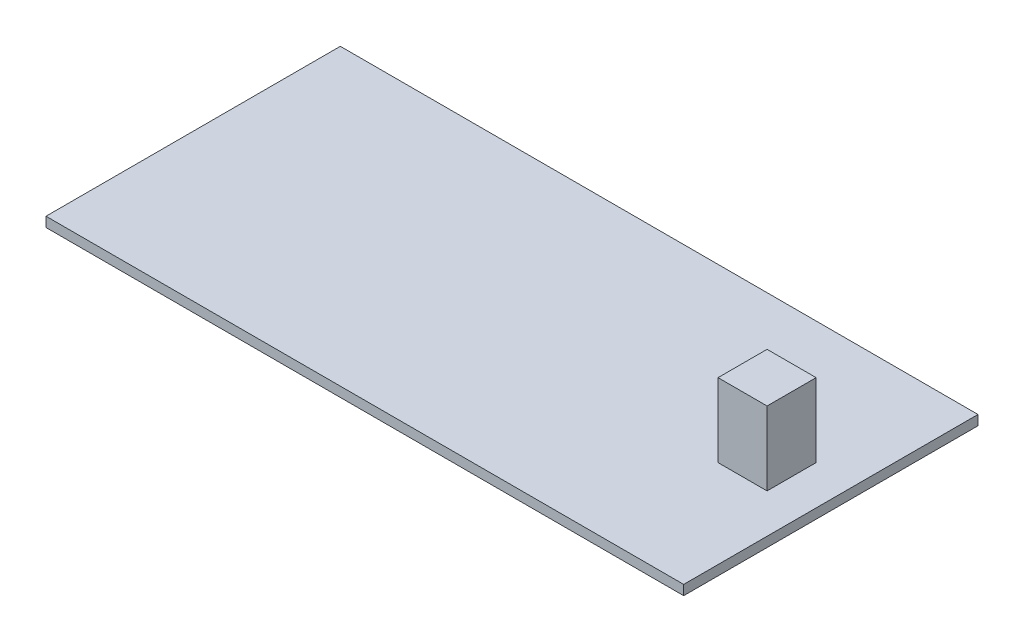
ISO-10303-21;
HEADER;
FILE_DESCRIPTION(('STEP AP214'),'2;1');
FILE_NAME('part.step','',(''),(''),'','','');
FILE_SCHEMA(('AUTOMOTIVE_DESIGN { 1 0 10303 214 1 1 1 1 }'));
ENDSEC;
DATA;
#1=APPLICATION_CONTEXT('core data for automotive mechanical design processes');
#2=APPLICATION_PROTOCOL_DEFINITION('international standard','automotive_design',2000,#1);
#3=PRODUCT_CONTEXT('',#1,'mechanical');
#4=PRODUCT('Part','Part','',(#3));
#5=PRODUCT_RELATED_PRODUCT_CATEGORY('part','',(#4));
#6=PRODUCT_DEFINITION_FORMATION('','',#4);
#7=PRODUCT_DEFINITION_CONTEXT('part definition',#1,'design');
#8=PRODUCT_DEFINITION('design','',#6,#7);
#9=PRODUCT_DEFINITION_SHAPE('','',#8);
#10=(LENGTH_UNIT() NAMED_UNIT(*) SI_UNIT(.MILLI.,.METRE.));
#11=(NAMED_UNIT(*) PLANE_ANGLE_UNIT() SI_UNIT($,.RADIAN.));
#12=(NAMED_UNIT(*) SI_UNIT($,.STERADIAN.) SOLID_ANGLE_UNIT());
#13=UNCERTAINTY_MEASURE_WITH_UNIT(LENGTH_MEASURE(1.E-05),#10,'distance_accuracy_value','');
#14=(GEOMETRIC_REPRESENTATION_CONTEXT(3) GLOBAL_UNCERTAINTY_ASSIGNED_CONTEXT((#13)) GLOBAL_UNIT_ASSIGNED_CONTEXT((#10,
#11,#12)) REPRESENTATION_CONTEXT('',''));
#15=CARTESIAN_POINT('',(0.,0.,0.));
#16=DIRECTION('',(0.,0.,1.));
#17=DIRECTION('',(1.,0.,0.));
#18=AXIS2_PLACEMENT_3D('',#15,#16,#17);
#19=CARTESIAN_POINT('',(0.,5.,0.));
#20=DIRECTION('',(0.,1.,0.));
#21=DIRECTION('',(0.,0.,1.));
#22=AXIS2_PLACEMENT_3D('',#19,#20,#21);
#23=PLANE('',#22);
#24=DIRECTION('',(1.,0.,0.));
#25=VECTOR('',#24,1.);
#26=CARTESIAN_POINT('',(0.,5.,150.));
#27=LINE('',#26,#25);
#28=CARTESIAN_POINT('',(-150.,5.,150.));
#29=VERTEX_POINT('',#28);
#30=CARTESIAN_POINT('',(500.,5.,150.));
#31=VERTEX_POINT('',#30);
#32=EDGE_CURVE('E145',#29,#31,#27,.T.);
#33=ORIENTED_EDGE('',*,*,#32,.T.);
#34=DIRECTION('',(0.,0.,1.));
#35=VECTOR('',#34,1.);
#36=CARTESIAN_POINT('',(500.,5.,0.));
#37=LINE('',#36,#35);
#38=CARTESIAN_POINT('',(500.,5.,-150.));
#39=VERTEX_POINT('',#38);
#40=EDGE_CURVE('E150',#39,#31,#37,.T.);
#41=ORIENTED_EDGE('',*,*,#40,.F.);
#42=DIRECTION('',(1.,0.,0.));
#43=VECTOR('',#42,1.);
#44=CARTESIAN_POINT('',(0.,5.,-150.));
#45=LINE('',#44,#43);
#46=CARTESIAN_POINT('',(-150.,5.,-150.));
#47=VERTEX_POINT('',#46);
#48=EDGE_CURVE('E170',#47,#39,#45,.T.);
#49=ORIENTED_EDGE('',*,*,#48,.F.);
#50=DIRECTION('',(0.,0.,1.));
#51=VECTOR('',#50,1.);
#52=CARTESIAN_POINT('',(-150.,5.,0.));
#53=LINE('',#52,#51);
#54=EDGE_CURVE('E158',#47,#29,#53,.T.);
#55=ORIENTED_EDGE('',*,*,#54,.T.);
#56=EDGE_LOOP('',(#33,#41,#49,#55));
#57=FACE_BOUND('',#56,.T.);
#58=DIRECTION('',(-1.,0.,0.));
#59=VECTOR('',#58,1.);
#60=CARTESIAN_POINT('',(410.,5.,-25.));
#61=LINE('',#60,#59);
#62=CARTESIAN_POINT('',(460.,5.,-25.));
#63=VERTEX_POINT('',#62);
#64=CARTESIAN_POINT('',(410.,5.,-25.));
#65=VERTEX_POINT('',#64);
#66=EDGE_CURVE('E293',#63,#65,#61,.T.);
#67=ORIENTED_EDGE('',*,*,#66,.F.);
#68=DIRECTION('',(0.,0.,-1.));
#69=VECTOR('',#68,1.);
#70=CARTESIAN_POINT('',(460.,5.,25.));
#71=LINE('',#70,#69);
#72=CARTESIAN_POINT('',(460.,5.,25.));
#73=VERTEX_POINT('',#72);
#74=EDGE_CURVE('E142',#73,#63,#71,.T.);
#75=ORIENTED_EDGE('',*,*,#74,.F.);
#76=DIRECTION('',(1.,0.,0.));
#77=VECTOR('',#76,1.);
#78=CARTESIAN_POINT('',(410.,5.,25.));
#79=LINE('',#78,#77);
#80=CARTESIAN_POINT('',(410.,5.,25.));
#81=VERTEX_POINT('',#80);
#82=EDGE_CURVE('E138',#81,#73,#79,.T.);
#83=ORIENTED_EDGE('',*,*,#82,.F.);
#84=DIRECTION('',(0.,0.,1.));
#85=VECTOR('',#84,1.);
#86=CARTESIAN_POINT('',(410.,5.,25.));
#87=LINE('',#86,#85);
#88=EDGE_CURVE('E289',#65,#81,#87,.T.);
#89=ORIENTED_EDGE('',*,*,#88,.F.);
#90=EDGE_LOOP('',(#67,#75,#83,#89));
#91=FACE_BOUND('',#90,.T.);
#92=ADVANCED_FACE('F43',(#57,#91),#23,.T.);
#93=CARTESIAN_POINT('',(0.,-5.,150.));
#94=DIRECTION('',(0.,0.,1.));
#95=DIRECTION('',(1.,0.,0.));
#96=AXIS2_PLACEMENT_3D('',#93,#94,#95);
#97=PLANE('',#96);
#98=ORIENTED_EDGE('',*,*,#32,.F.);
#99=DIRECTION('',(0.,1.,0.));
#100=VECTOR('',#99,1.);
#101=CARTESIAN_POINT('',(-150.,-5.,150.));
#102=LINE('',#101,#100);
#103=CARTESIAN_POINT('',(-150.,-5.,150.));
#104=VERTEX_POINT('',#103);
#105=EDGE_CURVE('E11',#104,#29,#102,.T.);
#106=ORIENTED_EDGE('',*,*,#105,.F.);
#107=DIRECTION('',(1.,0.,0.));
#108=VECTOR('',#107,1.);
#109=CARTESIAN_POINT('',(0.,-5.,150.));
#110=LINE('',#109,#108);
#111=CARTESIAN_POINT('',(500.,-5.,150.));
#112=VERTEX_POINT('',#111);
#113=EDGE_CURVE('E155',#104,#112,#110,.T.);
#114=ORIENTED_EDGE('',*,*,#113,.T.);
#115=DIRECTION('',(0.,1.,0.));
#116=VECTOR('',#115,1.);
#117=CARTESIAN_POINT('',(500.,-5.,150.));
#118=LINE('',#117,#116);
#119=EDGE_CURVE('E47',#112,#31,#118,.T.);
#120=ORIENTED_EDGE('',*,*,#119,.T.);
#121=EDGE_LOOP('',(#98,#106,#114,#120));
#122=FACE_BOUND('',#121,.T.);
#123=ADVANCED_FACE('F45',(#122),#97,.T.);
#124=CARTESIAN_POINT('',(-150.,-5.,0.));
#125=DIRECTION('',(-1.,0.,0.));
#126=DIRECTION('',(0.,0.,1.));
#127=AXIS2_PLACEMENT_3D('',#124,#125,#126);
#128=PLANE('',#127);
#129=ORIENTED_EDGE('',*,*,#54,.F.);
#130=DIRECTION('',(0.,1.,0.));
#131=VECTOR('',#130,1.);
#132=CARTESIAN_POINT('',(-150.,-5.,-150.));
#133=LINE('',#132,#131);
#134=CARTESIAN_POINT('',(-150.,-5.,-150.));
#135=VERTEX_POINT('',#134);
#136=EDGE_CURVE('E53',#135,#47,#133,.T.);
#137=ORIENTED_EDGE('',*,*,#136,.F.);
#138=DIRECTION('',(0.,0.,1.));
#139=VECTOR('',#138,1.);
#140=CARTESIAN_POINT('',(-150.,-5.,0.));
#141=LINE('',#140,#139);
#142=EDGE_CURVE('E164',#135,#104,#141,.T.);
#143=ORIENTED_EDGE('',*,*,#142,.T.);
#144=ORIENTED_EDGE('',*,*,#105,.T.);
#145=EDGE_LOOP('',(#129,#137,#143,#144));
#146=FACE_BOUND('',#145,.T.);
#147=ADVANCED_FACE('F188',(#146),#128,.T.);
#148=CARTESIAN_POINT('',(0.,-5.,-150.));
#149=DIRECTION('',(0.,0.,1.));
#150=DIRECTION('',(1.,0.,0.));
#151=AXIS2_PLACEMENT_3D('',#148,#149,#150);
#152=PLANE('',#151);
#153=ORIENTED_EDGE('',*,*,#48,.T.);
#154=DIRECTION('',(0.,1.,0.));
#155=VECTOR('',#154,1.);
#156=CARTESIAN_POINT('',(500.,-5.,-150.));
#157=LINE('',#156,#155);
#158=CARTESIAN_POINT('',(500.,-5.,-150.));
#159=VERTEX_POINT('',#158);
#160=EDGE_CURVE('E177',#159,#39,#157,.T.);
#161=ORIENTED_EDGE('',*,*,#160,.F.);
#162=DIRECTION('',(1.,0.,0.));
#163=VECTOR('',#162,1.);
#164=CARTESIAN_POINT('',(0.,-5.,-150.));
#165=LINE('',#164,#163);
#166=EDGE_CURVE('E161',#135,#159,#165,.T.);
#167=ORIENTED_EDGE('',*,*,#166,.F.);
#168=ORIENTED_EDGE('',*,*,#136,.T.);
#169=EDGE_LOOP('',(#153,#161,#167,#168));
#170=FACE_BOUND('',#169,.T.);
#171=ADVANCED_FACE('F192',(#170),#152,.F.);
#172=CARTESIAN_POINT('',(500.,-5.,0.));
#173=DIRECTION('',(-1.,0.,0.));
#174=DIRECTION('',(0.,0.,1.));
#175=AXIS2_PLACEMENT_3D('',#172,#173,#174);
#176=PLANE('',#175);
#177=ORIENTED_EDGE('',*,*,#40,.T.);
#178=ORIENTED_EDGE('',*,*,#119,.F.);
#179=DIRECTION('',(0.,0.,1.));
#180=VECTOR('',#179,1.);
#181=CARTESIAN_POINT('',(500.,-5.,0.));
#182=LINE('',#181,#180);
#183=EDGE_CURVE('E94',#159,#112,#182,.T.);
#184=ORIENTED_EDGE('',*,*,#183,.F.);
#185=ORIENTED_EDGE('',*,*,#160,.T.);
#186=EDGE_LOOP('',(#177,#178,#184,#185));
#187=FACE_BOUND('',#186,.T.);
#188=ADVANCED_FACE('F184',(#187),#176,.F.);
#189=CARTESIAN_POINT('',(0.,-5.,0.));
#190=DIRECTION('',(0.,1.,0.));
#191=DIRECTION('',(0.,0.,1.));
#192=AXIS2_PLACEMENT_3D('',#189,#190,#191);
#193=PLANE('',#192);
#194=ORIENTED_EDGE('',*,*,#113,.F.);
#195=ORIENTED_EDGE('',*,*,#142,.F.);
#196=ORIENTED_EDGE('',*,*,#166,.T.);
#197=ORIENTED_EDGE('',*,*,#183,.T.);
#198=EDGE_LOOP('',(#194,#195,#196,#197));
#199=FACE_BOUND('',#198,.T.);
#200=ADVANCED_FACE('F193',(#199),#193,.F.);
#201=CARTESIAN_POINT('',(460.,80.,25.));
#202=DIRECTION('',(-1.,0.,0.));
#203=DIRECTION('',(0.,0.,1.));
#204=AXIS2_PLACEMENT_3D('',#201,#202,#203);
#205=PLANE('',#204);
#206=ORIENTED_EDGE('',*,*,#74,.T.);
#207=DIRECTION('',(0.,-1.,0.));
#208=VECTOR('',#207,1.);
#209=CARTESIAN_POINT('',(460.,80.,-25.));
#210=LINE('',#209,#208);
#211=CARTESIAN_POINT('',(460.,80.,-25.));
#212=VERTEX_POINT('',#211);
#213=EDGE_CURVE('E121',#212,#63,#210,.T.);
#214=ORIENTED_EDGE('',*,*,#213,.F.);
#215=DIRECTION('',(0.,0.,-1.));
#216=VECTOR('',#215,1.);
#217=CARTESIAN_POINT('',(460.,80.,25.));
#218=LINE('',#217,#216);
#219=CARTESIAN_POINT('',(460.,80.,25.));
#220=VERTEX_POINT('',#219);
#221=EDGE_CURVE('E129',#220,#212,#218,.T.);
#222=ORIENTED_EDGE('',*,*,#221,.F.);
#223=DIRECTION('',(0.,-1.,0.));
#224=VECTOR('',#223,1.);
#225=CARTESIAN_POINT('',(460.,80.,25.));
#226=LINE('',#225,#224);
#227=EDGE_CURVE('E286',#220,#73,#226,.T.);
#228=ORIENTED_EDGE('',*,*,#227,.T.);
#229=EDGE_LOOP('',(#206,#214,#222,#228));
#230=FACE_BOUND('',#229,.T.);
#231=ADVANCED_FACE('F140',(#230),#205,.F.);
#232=CARTESIAN_POINT('',(410.,80.,-25.));
#233=DIRECTION('',(0.,0.,1.));
#234=DIRECTION('',(1.,0.,0.));
#235=AXIS2_PLACEMENT_3D('',#232,#233,#234);
#236=PLANE('',#235);
#237=ORIENTED_EDGE('',*,*,#66,.T.);
#238=DIRECTION('',(0.,-1.,0.));
#239=VECTOR('',#238,1.);
#240=CARTESIAN_POINT('',(410.,80.,-25.));
#241=LINE('',#240,#239);
#242=CARTESIAN_POINT('',(410.,80.,-25.));
#243=VERTEX_POINT('',#242);
#244=EDGE_CURVE('E124',#243,#65,#241,.T.);
#245=ORIENTED_EDGE('',*,*,#244,.F.);
#246=DIRECTION('',(-1.,0.,0.));
#247=VECTOR('',#246,1.);
#248=CARTESIAN_POINT('',(410.,80.,-25.));
#249=LINE('',#248,#247);
#250=EDGE_CURVE('E117',#212,#243,#249,.T.);
#251=ORIENTED_EDGE('',*,*,#250,.F.);
#252=ORIENTED_EDGE('',*,*,#213,.T.);
#253=EDGE_LOOP('',(#237,#245,#251,#252));
#254=FACE_BOUND('',#253,.T.);
#255=ADVANCED_FACE('F119',(#254),#236,.F.);
#256=CARTESIAN_POINT('',(410.,80.,25.));
#257=DIRECTION('',(1.,0.,0.));
#258=DIRECTION('',(0.,0.,-1.));
#259=AXIS2_PLACEMENT_3D('',#256,#257,#258);
#260=PLANE('',#259);
#261=ORIENTED_EDGE('',*,*,#88,.T.);
#262=DIRECTION('',(0.,-1.,0.));
#263=VECTOR('',#262,1.);
#264=CARTESIAN_POINT('',(410.,80.,25.));
#265=LINE('',#264,#263);
#266=CARTESIAN_POINT('',(410.,80.,25.));
#267=VERTEX_POINT('',#266);
#268=EDGE_CURVE('E61',#267,#81,#265,.T.);
#269=ORIENTED_EDGE('',*,*,#268,.F.);
#270=DIRECTION('',(0.,0.,1.));
#271=VECTOR('',#270,1.);
#272=CARTESIAN_POINT('',(410.,80.,25.));
#273=LINE('',#272,#271);
#274=EDGE_CURVE('E128',#243,#267,#273,.T.);
#275=ORIENTED_EDGE('',*,*,#274,.F.);
#276=ORIENTED_EDGE('',*,*,#244,.T.);
#277=EDGE_LOOP('',(#261,#269,#275,#276));
#278=FACE_BOUND('',#277,.T.);
#279=ADVANCED_FACE('F246',(#278),#260,.F.);
#280=CARTESIAN_POINT('',(410.,80.,25.));
#281=DIRECTION('',(0.,0.,-1.));
#282=DIRECTION('',(-1.,0.,0.));
#283=AXIS2_PLACEMENT_3D('',#280,#281,#282);
#284=PLANE('',#283);
#285=ORIENTED_EDGE('',*,*,#82,.T.);
#286=ORIENTED_EDGE('',*,*,#227,.F.);
#287=DIRECTION('',(1.,0.,0.));
#288=VECTOR('',#287,1.);
#289=CARTESIAN_POINT('',(410.,80.,25.));
#290=LINE('',#289,#288);
#291=EDGE_CURVE('E133',#267,#220,#290,.T.);
#292=ORIENTED_EDGE('',*,*,#291,.F.);
#293=ORIENTED_EDGE('',*,*,#268,.T.);
#294=EDGE_LOOP('',(#285,#286,#292,#293));
#295=FACE_BOUND('',#294,.T.);
#296=ADVANCED_FACE('F256',(#295),#284,.F.);
#297=CARTESIAN_POINT('',(0.,80.,0.));
#298=DIRECTION('',(0.,-1.,0.));
#299=DIRECTION('',(0.,0.,-1.));
#300=AXIS2_PLACEMENT_3D('',#297,#298,#299);
#301=PLANE('',#300);
#302=ORIENTED_EDGE('',*,*,#221,.T.);
#303=ORIENTED_EDGE('',*,*,#250,.T.);
#304=ORIENTED_EDGE('',*,*,#274,.T.);
#305=ORIENTED_EDGE('',*,*,#291,.T.);
#306=EDGE_LOOP('',(#302,#303,#304,#305));
#307=FACE_BOUND('',#306,.T.);
#308=ADVANCED_FACE('F132',(#307),#301,.F.);
#309=CLOSED_SHELL('',(#92,#123,#147,#171,#188,#200,#231,#255,#279,#296,#308));
#310=MANIFOLD_SOLID_BREP('B2',#309);
#311=ADVANCED_BREP_SHAPE_REPRESENTATION('',(#18,#310),#14);
#312=SHAPE_DEFINITION_REPRESENTATION(#9,#311);
ENDSEC;
END-ISO-10303-21;
